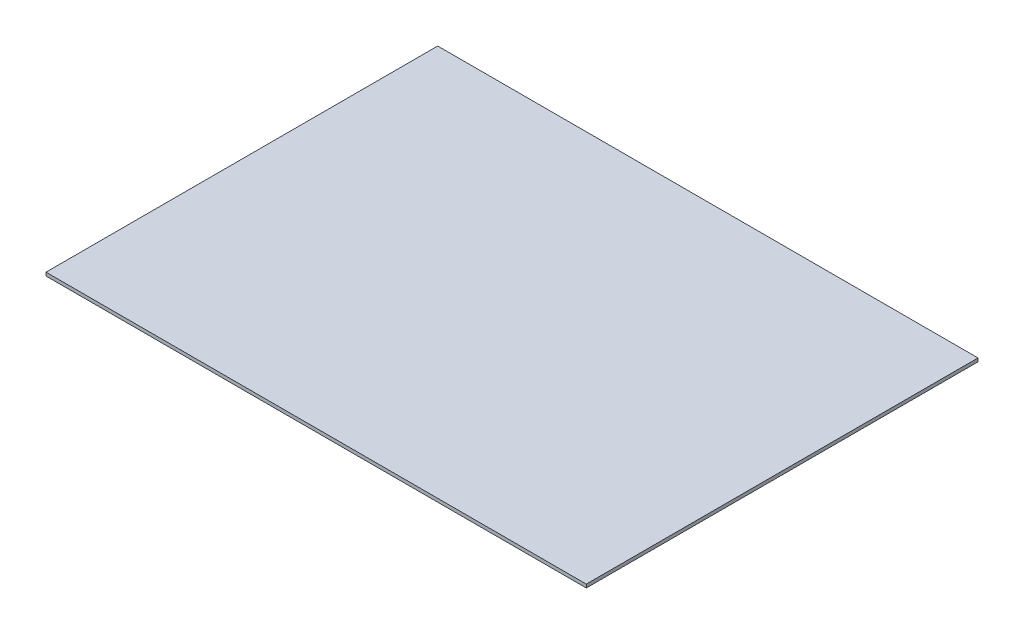
ISO-10303-21;
HEADER;
FILE_DESCRIPTION(('STEP AP214'),'2;1');
FILE_NAME('part.step','',(''),(''),'','','');
FILE_SCHEMA(('AUTOMOTIVE_DESIGN { 1 0 10303 214 1 1 1 1 }'));
ENDSEC;
DATA;
#1=APPLICATION_CONTEXT('core data for automotive mechanical design processes');
#2=APPLICATION_PROTOCOL_DEFINITION('international standard','automotive_design',2000,#1);
#3=PRODUCT_CONTEXT('',#1,'mechanical');
#4=PRODUCT('Part','Part','',(#3));
#5=PRODUCT_RELATED_PRODUCT_CATEGORY('part','',(#4));
#6=PRODUCT_DEFINITION_FORMATION('','',#4);
#7=PRODUCT_DEFINITION_CONTEXT('part definition',#1,'design');
#8=PRODUCT_DEFINITION('design','',#6,#7);
#9=PRODUCT_DEFINITION_SHAPE('','',#8);
#10=(LENGTH_UNIT() NAMED_UNIT(*) SI_UNIT(.MILLI.,.METRE.));
#11=(NAMED_UNIT(*) PLANE_ANGLE_UNIT() SI_UNIT($,.RADIAN.));
#12=(NAMED_UNIT(*) SI_UNIT($,.STERADIAN.) SOLID_ANGLE_UNIT());
#13=UNCERTAINTY_MEASURE_WITH_UNIT(LENGTH_MEASURE(1.E-05),#10,'distance_accuracy_value','');
#14=(GEOMETRIC_REPRESENTATION_CONTEXT(3) GLOBAL_UNCERTAINTY_ASSIGNED_CONTEXT((#13)) GLOBAL_UNIT_ASSIGNED_CONTEXT((#10,
#11,#12)) REPRESENTATION_CONTEXT('',''));
#15=CARTESIAN_POINT('',(0.,0.,0.));
#16=DIRECTION('',(0.,0.,1.));
#17=DIRECTION('',(1.,0.,0.));
#18=AXIS2_PLACEMENT_3D('',#15,#16,#17);
#19=CARTESIAN_POINT('',(10.,0.125,-7.25));
#20=DIRECTION('',(-1.,0.,0.));
#21=DIRECTION('',(0.,0.,1.));
#22=AXIS2_PLACEMENT_3D('',#19,#20,#21);
#23=PLANE('',#22);
#24=DIRECTION('',(0.,0.,-1.));
#25=VECTOR('',#24,1.);
#26=CARTESIAN_POINT('',(10.,0.,-7.25));
#27=LINE('',#26,#25);
#28=CARTESIAN_POINT('',(10.,0.,7.25));
#29=VERTEX_POINT('',#28);
#30=CARTESIAN_POINT('',(10.,0.,-7.25));
#31=VERTEX_POINT('',#30);
#32=EDGE_CURVE('E93',#29,#31,#27,.T.);
#33=ORIENTED_EDGE('',*,*,#32,.T.);
#34=DIRECTION('',(0.,-1.,0.));
#35=VECTOR('',#34,1.);
#36=CARTESIAN_POINT('',(10.,0.125,-7.25));
#37=LINE('',#36,#35);
#38=CARTESIAN_POINT('',(10.,0.125,-7.25));
#39=VERTEX_POINT('',#38);
#40=EDGE_CURVE('E11',#39,#31,#37,.T.);
#41=ORIENTED_EDGE('',*,*,#40,.F.);
#42=DIRECTION('',(0.,0.,-1.));
#43=VECTOR('',#42,1.);
#44=CARTESIAN_POINT('',(10.,0.125,-7.25));
#45=LINE('',#44,#43);
#46=CARTESIAN_POINT('',(10.,0.125,7.25));
#47=VERTEX_POINT('',#46);
#48=EDGE_CURVE('E81',#47,#39,#45,.T.);
#49=ORIENTED_EDGE('',*,*,#48,.F.);
#50=DIRECTION('',(0.,-1.,0.));
#51=VECTOR('',#50,1.);
#52=CARTESIAN_POINT('',(10.,0.125,7.25));
#53=LINE('',#52,#51);
#54=EDGE_CURVE('E89',#47,#29,#53,.T.);
#55=ORIENTED_EDGE('',*,*,#54,.T.);
#56=EDGE_LOOP('',(#33,#41,#49,#55));
#57=FACE_BOUND('',#56,.T.);
#58=ADVANCED_FACE('F30',(#57),#23,.F.);
#59=CARTESIAN_POINT('',(-10.,0.125,-7.25));
#60=DIRECTION('',(0.,0.,1.));
#61=DIRECTION('',(1.,0.,0.));
#62=AXIS2_PLACEMENT_3D('',#59,#60,#61);
#63=PLANE('',#62);
#64=DIRECTION('',(-1.,0.,0.));
#65=VECTOR('',#64,1.);
#66=CARTESIAN_POINT('',(-10.,0.,-7.25));
#67=LINE('',#66,#65);
#68=CARTESIAN_POINT('',(-10.,0.,-7.25));
#69=VERTEX_POINT('',#68);
#70=EDGE_CURVE('E85',#31,#69,#67,.T.);
#71=ORIENTED_EDGE('',*,*,#70,.T.);
#72=DIRECTION('',(0.,-1.,0.));
#73=VECTOR('',#72,1.);
#74=CARTESIAN_POINT('',(-10.,0.125,-7.25));
#75=LINE('',#74,#73);
#76=CARTESIAN_POINT('',(-10.,0.125,-7.25));
#77=VERTEX_POINT('',#76);
#78=EDGE_CURVE('E38',#77,#69,#75,.T.);
#79=ORIENTED_EDGE('',*,*,#78,.F.);
#80=DIRECTION('',(-1.,0.,0.));
#81=VECTOR('',#80,1.);
#82=CARTESIAN_POINT('',(-10.,0.125,-7.25));
#83=LINE('',#82,#81);
#84=EDGE_CURVE('E76',#39,#77,#83,.T.);
#85=ORIENTED_EDGE('',*,*,#84,.F.);
#86=ORIENTED_EDGE('',*,*,#40,.T.);
#87=EDGE_LOOP('',(#71,#79,#85,#86));
#88=FACE_BOUND('',#87,.T.);
#89=ADVANCED_FACE('F84',(#88),#63,.F.);
#90=CARTESIAN_POINT('',(-10.,0.125,-7.25));
#91=DIRECTION('',(1.,0.,0.));
#92=DIRECTION('',(0.,0.,-1.));
#93=AXIS2_PLACEMENT_3D('',#90,#91,#92);
#94=PLANE('',#93);
#95=DIRECTION('',(0.,0.,1.));
#96=VECTOR('',#95,1.);
#97=CARTESIAN_POINT('',(-10.,0.,-7.25));
#98=LINE('',#97,#96);
#99=CARTESIAN_POINT('',(-10.,0.,7.25));
#100=VERTEX_POINT('',#99);
#101=EDGE_CURVE('E63',#69,#100,#98,.T.);
#102=ORIENTED_EDGE('',*,*,#101,.T.);
#103=DIRECTION('',(0.,-1.,0.));
#104=VECTOR('',#103,1.);
#105=CARTESIAN_POINT('',(-10.,0.125,7.25));
#106=LINE('',#105,#104);
#107=CARTESIAN_POINT('',(-10.,0.125,7.25));
#108=VERTEX_POINT('',#107);
#109=EDGE_CURVE('E86',#108,#100,#106,.T.);
#110=ORIENTED_EDGE('',*,*,#109,.F.);
#111=DIRECTION('',(0.,0.,1.));
#112=VECTOR('',#111,1.);
#113=CARTESIAN_POINT('',(-10.,0.125,-7.25));
#114=LINE('',#113,#112);
#115=EDGE_CURVE('E79',#77,#108,#114,.T.);
#116=ORIENTED_EDGE('',*,*,#115,.F.);
#117=ORIENTED_EDGE('',*,*,#78,.T.);
#118=EDGE_LOOP('',(#102,#110,#116,#117));
#119=FACE_BOUND('',#118,.T.);
#120=ADVANCED_FACE('F87',(#119),#94,.F.);
#121=CARTESIAN_POINT('',(-10.,0.125,7.25));
#122=DIRECTION('',(0.,0.,-1.));
#123=DIRECTION('',(-1.,0.,0.));
#124=AXIS2_PLACEMENT_3D('',#121,#122,#123);
#125=PLANE('',#124);
#126=DIRECTION('',(1.,0.,0.));
#127=VECTOR('',#126,1.);
#128=CARTESIAN_POINT('',(-10.,0.,7.25));
#129=LINE('',#128,#127);
#130=EDGE_CURVE('E69',#100,#29,#129,.T.);
#131=ORIENTED_EDGE('',*,*,#130,.T.);
#132=ORIENTED_EDGE('',*,*,#54,.F.);
#133=DIRECTION('',(1.,0.,0.));
#134=VECTOR('',#133,1.);
#135=CARTESIAN_POINT('',(-10.,0.125,7.25));
#136=LINE('',#135,#134);
#137=EDGE_CURVE('E46',#108,#47,#136,.T.);
#138=ORIENTED_EDGE('',*,*,#137,.F.);
#139=ORIENTED_EDGE('',*,*,#109,.T.);
#140=EDGE_LOOP('',(#131,#132,#138,#139));
#141=FACE_BOUND('',#140,.T.);
#142=ADVANCED_FACE('F100',(#141),#125,.F.);
#143=CARTESIAN_POINT('',(10.,0.125,7.25));
#144=DIRECTION('',(0.,1.,0.));
#145=DIRECTION('',(0.,0.,1.));
#146=AXIS2_PLACEMENT_3D('',#143,#144,#145);
#147=PLANE('',#146);
#148=ORIENTED_EDGE('',*,*,#48,.T.);
#149=ORIENTED_EDGE('',*,*,#84,.T.);
#150=ORIENTED_EDGE('',*,*,#115,.T.);
#151=ORIENTED_EDGE('',*,*,#137,.T.);
#152=EDGE_LOOP('',(#148,#149,#150,#151));
#153=FACE_BOUND('',#152,.T.);
#154=ADVANCED_FACE('F77',(#153),#147,.T.);
#155=CARTESIAN_POINT('',(10.,0.,7.25));
#156=DIRECTION('',(0.,1.,0.));
#157=DIRECTION('',(0.,0.,1.));
#158=AXIS2_PLACEMENT_3D('',#155,#156,#157);
#159=PLANE('',#158);
#160=ORIENTED_EDGE('',*,*,#32,.F.);
#161=ORIENTED_EDGE('',*,*,#130,.F.);
#162=ORIENTED_EDGE('',*,*,#101,.F.);
#163=ORIENTED_EDGE('',*,*,#70,.F.);
#164=EDGE_LOOP('',(#160,#161,#162,#163));
#165=FACE_BOUND('',#164,.T.);
#166=ADVANCED_FACE('F103',(#165),#159,.F.);
#167=CLOSED_SHELL('',(#58,#89,#120,#142,#154,#166));
#168=MANIFOLD_SOLID_BREP('B2',#167);
#169=ADVANCED_BREP_SHAPE_REPRESENTATION('',(#18,#168),#14);
#170=SHAPE_DEFINITION_REPRESENTATION(#9,#169);
ENDSEC;
END-ISO-10303-21;
